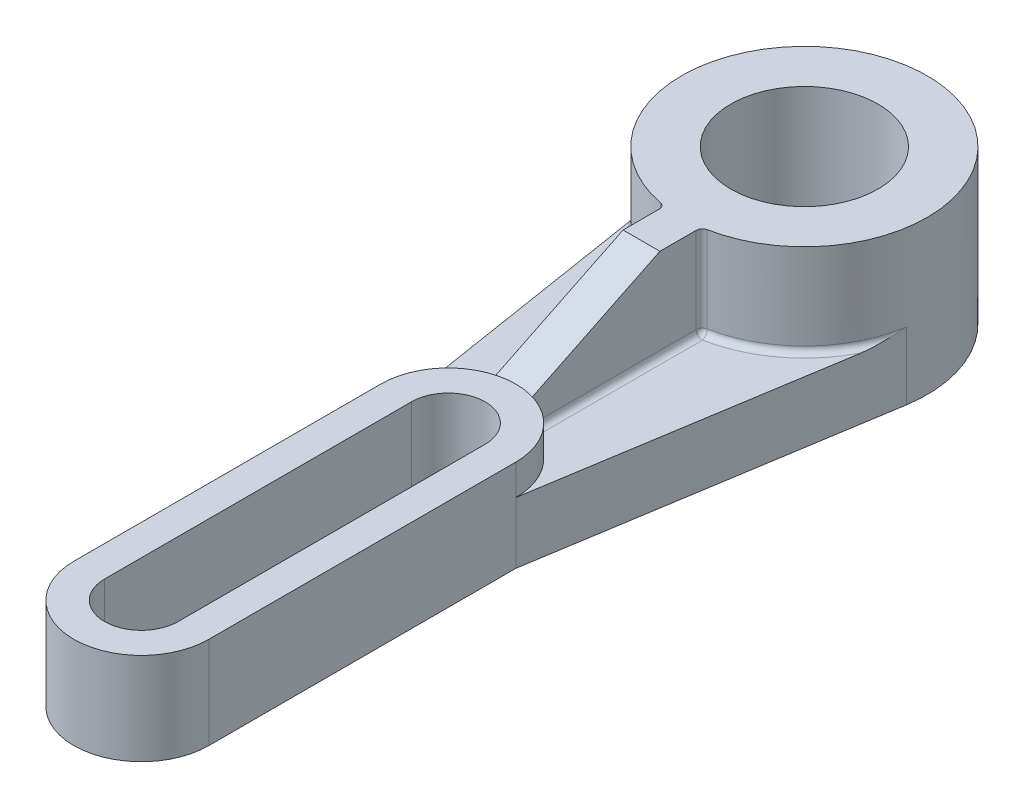
ISO-10303-21;
HEADER;
FILE_DESCRIPTION(('STEP AP214'),'2;1');
FILE_NAME('part.step','',(''),(''),'','','');
FILE_SCHEMA(('AUTOMOTIVE_DESIGN { 1 0 10303 214 1 1 1 1 }'));
ENDSEC;
DATA;
#1=APPLICATION_CONTEXT('core data for automotive mechanical design processes');
#2=APPLICATION_PROTOCOL_DEFINITION('international standard','automotive_design',2000,#1);
#3=PRODUCT_CONTEXT('',#1,'mechanical');
#4=PRODUCT('Part','Part','',(#3));
#5=PRODUCT_RELATED_PRODUCT_CATEGORY('part','',(#4));
#6=PRODUCT_DEFINITION_FORMATION('','',#4);
#7=PRODUCT_DEFINITION_CONTEXT('part definition',#1,'design');
#8=PRODUCT_DEFINITION('design','',#6,#7);
#9=PRODUCT_DEFINITION_SHAPE('','',#8);
#10=(LENGTH_UNIT() NAMED_UNIT(*) SI_UNIT(.MILLI.,.METRE.));
#11=(NAMED_UNIT(*) PLANE_ANGLE_UNIT() SI_UNIT($,.RADIAN.));
#12=(NAMED_UNIT(*) SI_UNIT($,.STERADIAN.) SOLID_ANGLE_UNIT());
#13=UNCERTAINTY_MEASURE_WITH_UNIT(LENGTH_MEASURE(1.E-05),#10,'distance_accuracy_value','');
#14=(GEOMETRIC_REPRESENTATION_CONTEXT(3) GLOBAL_UNCERTAINTY_ASSIGNED_CONTEXT((#13)) GLOBAL_UNIT_ASSIGNED_CONTEXT((#10,
#11,#12)) REPRESENTATION_CONTEXT('',''));
#15=CARTESIAN_POINT('',(0.,0.,0.));
#16=DIRECTION('',(0.,0.,1.));
#17=DIRECTION('',(1.,0.,0.));
#18=AXIS2_PLACEMENT_3D('',#15,#16,#17);
#19=CARTESIAN_POINT('',(0.,10.,0.));
#20=DIRECTION('',(0.,1.,0.));
#21=DIRECTION('',(0.,0.,1.));
#22=AXIS2_PLACEMENT_3D('',#19,#20,#21);
#23=PLANE('',#22);
#24=CARTESIAN_POINT('',(0.,10.,0.));
#25=DIRECTION('',(0.,1.,0.));
#26=DIRECTION('',(0.,0.,1.));
#27=AXIS2_PLACEMENT_3D('',#24,#25,#26);
#28=CIRCLE('',#27,11.);
#29=CARTESIAN_POINT('',(-4.,10.,-10.2469507659596));
#30=VERTEX_POINT('',#29);
#31=CARTESIAN_POINT('',(-11.,10.,0.));
#32=VERTEX_POINT('',#31);
#33=EDGE_CURVE('E236',#30,#32,#28,.T.);
#34=ORIENTED_EDGE('',*,*,#33,.F.);
#35=DIRECTION('',(0.,0.,-1.));
#36=VECTOR('',#35,1.);
#37=CARTESIAN_POINT('',(-4.,10.,0.));
#38=LINE('',#37,#36);
#39=CARTESIAN_POINT('',(-4.,10.,-37.3844718719117));
#40=VERTEX_POINT('',#39);
#41=EDGE_CURVE('E321',#30,#40,#38,.T.);
#42=ORIENTED_EDGE('',*,*,#41,.T.);
#43=CARTESIAN_POINT('',(0.,10.,-58.));
#44=DIRECTION('',(0.,1.,0.));
#45=DIRECTION('',(0.,0.,1.));
#46=AXIS2_PLACEMENT_3D('',#43,#44,#45);
#47=CIRCLE('',#46,21.);
#48=CARTESIAN_POINT('',(-18.7414968926728,10.,-48.5260201487477));
#49=VERTEX_POINT('',#48);
#50=EDGE_CURVE('E319',#40,#49,#47,.F.);
#51=ORIENTED_EDGE('',*,*,#50,.T.);
#52=DIRECTION('',(-0.157540734752383,0.,-0.987512489487439));
#53=VECTOR('',#52,1.);
#54=CARTESIAN_POINT('',(-10.7269900858305,10.,1.71130787488106));
#55=LINE('',#54,#53);
#56=EDGE_CURVE('E261',#32,#49,#55,.T.);
#57=ORIENTED_EDGE('',*,*,#56,.F.);
#58=EDGE_LOOP('',(#34,#42,#51,#57));
#59=FACE_BOUND('',#58,.T.);
#60=ADVANCED_FACE('F35',(#59),#23,.T.);
#61=CARTESIAN_POINT('',(0.,15.,0.));
#62=DIRECTION('',(0.,-1.,0.));
#63=DIRECTION('',(0.,0.,-1.));
#64=AXIS2_PLACEMENT_3D('',#61,#62,#63);
#65=CYLINDRICAL_SURFACE('',#64,11.);
#66=DIRECTION('',(0.,-1.,0.));
#67=VECTOR('',#66,1.);
#68=CARTESIAN_POINT('',(-3.,15.,-10.5830052442584));
#69=LINE('',#68,#67);
#70=CARTESIAN_POINT('',(-3.,11.,-10.5830052442584));
#71=VERTEX_POINT('',#70);
#72=CARTESIAN_POINT('',(-3.,14.7962396583199,-10.5830052442584));
#73=VERTEX_POINT('',#72);
#74=EDGE_CURVE('E204',#71,#73,#69,.F.);
#75=ORIENTED_EDGE('',*,*,#74,.F.);
#76=CARTESIAN_POINT('',(-3.,11.,-10.5830052442584));
#77=CARTESIAN_POINT('',(-2.99999966462213,10.9727171425206,-10.5830047198332));
#78=CARTESIAN_POINT('',(-3.00111728618964,10.9454475483796,-10.5826885912731));
#79=CARTESIAN_POINT('',(-3.00557243898746,10.8911078182624,-10.5814243962143));
#80=CARTESIAN_POINT('',(-3.00890974648202,10.8640376624616,-10.5804763934061));
#81=CARTESIAN_POINT('',(-3.02220557907245,10.7835104152931,-10.5766896375541));
#82=CARTESIAN_POINT('',(-3.0354481967425,10.7305999324658,-10.5729081342815));
#83=CARTESIAN_POINT('',(-3.07023890671703,10.6278561078975,-10.5628574064479));
#84=CARTESIAN_POINT('',(-3.09178886923575,10.5780234619962,-10.5565876216961));
#85=CARTESIAN_POINT('',(-3.14245873589367,10.4827649112002,-10.5416150712215));
#86=CARTESIAN_POINT('',(-3.17157896706883,10.4373391968017,-10.5329122003879));
#87=CARTESIAN_POINT('',(-3.23682810977962,10.3515322270753,-10.5130451030744));
#88=CARTESIAN_POINT('',(-3.27303964352421,10.3112206963373,-10.5018516253187));
#89=CARTESIAN_POINT('',(-3.35106221286166,10.2372613745135,-10.4772159086684));
#90=CARTESIAN_POINT('',(-3.392874008833,10.2036144898638,-10.4637733643437));
#91=CARTESIAN_POINT('',(-3.48239617227888,10.1426060633734,-10.434328520433));
#92=CARTESIAN_POINT('',(-3.53026371583556,10.1155114505525,-10.41825203268));
#93=CARTESIAN_POINT('',(-3.62922769352996,10.069675801372,-10.3841921209767));
#94=CARTESIAN_POINT('',(-3.68032536060174,10.0509379770394,-10.366207967075));
#95=CARTESIAN_POINT('',(-3.77620776190619,10.0242986421606,-10.3316226029508));
#96=CARTESIAN_POINT('',(-3.82073627950436,10.0151639578288,-10.3152422272609));
#97=CARTESIAN_POINT('',(-3.91021840470716,10.0030150087099,-10.2816589845039));
#98=CARTESIAN_POINT('',(-3.95517103371468,9.99998904401214,-10.2644577544413));
#99=CARTESIAN_POINT('',(-4.,10.,-10.2469507659596));
#100=B_SPLINE_CURVE_WITH_KNOTS('',3,(#76,#77,#78,#79,#80,#81,#82,#83,#84,#85,#86,#87,#88,#89,
#90,#91,#92,#93,#94,#95,#96,#97,#98,#99),.UNSPECIFIED.,.F.,.F.,(4,2,2,2,2,2,2,2,2,2,2,4),(0.,
0.08179761532857,0.163586987023812,0.326761183188944,0.48997213587476,0.653190140453051,
0.818437036516682,0.983706391849412,1.15486938786012,1.32609811573937,1.47065929715447,
1.61494333969076),.UNSPECIFIED.);
#101=EDGE_CURVE('E328',#71,#30,#100,.T.);
#102=ORIENTED_EDGE('',*,*,#101,.T.);
#103=ORIENTED_EDGE('',*,*,#33,.T.);
#104=DIRECTION('',(0.,-1.,0.));
#105=VECTOR('',#104,1.);
#106=CARTESIAN_POINT('',(-11.,15.,0.));
#107=LINE('',#106,#105);
#108=CARTESIAN_POINT('',(-11.,15.,0.));
#109=VERTEX_POINT('',#108);
#110=EDGE_CURVE('E255',#109,#32,#107,.T.);
#111=ORIENTED_EDGE('',*,*,#110,.F.);
#112=CARTESIAN_POINT('',(0.,15.,0.));
#113=DIRECTION('',(0.,1.,0.));
#114=DIRECTION('',(0.,0.,1.));
#115=AXIS2_PLACEMENT_3D('',#112,#113,#114);
#116=CIRCLE('',#115,11.);
#117=CARTESIAN_POINT('',(0.,15.,-11.));
#118=VERTEX_POINT('',#117);
#119=EDGE_CURVE('E241',#118,#109,#116,.T.);
#120=ORIENTED_EDGE('',*,*,#119,.F.);
#121=CARTESIAN_POINT('',(0.,9.62495936071319,0.));
#122=DIRECTION('',(0.,-0.898472558001373,-0.439029682958305));
#123=DIRECTION('',(0.,-0.439029682958305,0.898472558001373));
#124=AXIS2_PLACEMENT_3D('',#121,#122,#123);
#125=ELLIPSE('',#124,12.2430005257692,11.);
#126=EDGE_CURVE('E311',#73,#118,#125,.T.);
#127=ORIENTED_EDGE('',*,*,#126,.F.);
#128=EDGE_LOOP('',(#75,#102,#103,#111,#120,#127));
#129=FACE_BOUND('',#128,.T.);
#130=ADVANCED_FACE('F349',(#129),#65,.T.);
#131=CARTESIAN_POINT('',(0.,10.,-58.));
#132=DIRECTION('',(0.,1.,0.));
#133=DIRECTION('',(0.,0.,1.));
#134=AXIS2_PLACEMENT_3D('',#131,#132,#133);
#135=CIRCLE('',#134,21.);
#136=CARTESIAN_POINT('',(18.7414968926728,10.,-48.5260201487477));
#137=VERTEX_POINT('',#136);
#138=CARTESIAN_POINT('',(4.,10.,-37.3844718719117));
#139=VERTEX_POINT('',#138);
#140=EDGE_CURVE('E53',#137,#139,#135,.F.);
#141=ORIENTED_EDGE('',*,*,#140,.T.);
#142=DIRECTION('',(0.,0.,-1.));
#143=VECTOR('',#142,1.);
#144=CARTESIAN_POINT('',(4.,10.,-10.5830052442584));
#145=LINE('',#144,#143);
#146=CARTESIAN_POINT('',(4.,10.,-10.2469507659596));
#147=VERTEX_POINT('',#146);
#148=EDGE_CURVE('E363',#139,#147,#145,.F.);
#149=ORIENTED_EDGE('',*,*,#148,.T.);
#150=CARTESIAN_POINT('',(11.,10.,0.));
#151=VERTEX_POINT('',#150);
#152=EDGE_CURVE('E250',#151,#147,#28,.T.);
#153=ORIENTED_EDGE('',*,*,#152,.F.);
#154=DIRECTION('',(0.157540734752382,0.,-0.987512489487439));
#155=VECTOR('',#154,1.);
#156=CARTESIAN_POINT('',(10.7269900858305,10.,1.71130787488106));
#157=LINE('',#156,#155);
#158=EDGE_CURVE('E259',#151,#137,#157,.T.);
#159=ORIENTED_EDGE('',*,*,#158,.T.);
#160=EDGE_LOOP('',(#141,#149,#153,#159));
#161=FACE_BOUND('',#160,.T.);
#162=ADVANCED_FACE('F351',(#161),#23,.T.);
#163=CARTESIAN_POINT('',(-11.,10.,0.));
#164=DIRECTION('',(1.,0.,0.));
#165=DIRECTION('',(0.,0.,-1.));
#166=AXIS2_PLACEMENT_3D('',#163,#164,#165);
#167=PLANE('',#166);
#168=DIRECTION('',(0.,0.,1.));
#169=VECTOR('',#168,1.);
#170=CARTESIAN_POINT('',(-11.,0.,0.));
#171=LINE('',#170,#169);
#172=CARTESIAN_POINT('',(-11.,0.,0.));
#173=VERTEX_POINT('',#172);
#174=CARTESIAN_POINT('',(-11.,0.,50.));
#175=VERTEX_POINT('',#174);
#176=EDGE_CURVE('E277',#173,#175,#171,.T.);
#177=ORIENTED_EDGE('',*,*,#176,.T.);
#178=DIRECTION('',(0.,-1.,0.));
#179=VECTOR('',#178,1.);
#180=CARTESIAN_POINT('',(-11.,10.,50.));
#181=LINE('',#180,#179);
#182=CARTESIAN_POINT('',(-11.,15.,50.));
#183=VERTEX_POINT('',#182);
#184=EDGE_CURVE('E308',#183,#175,#181,.T.);
#185=ORIENTED_EDGE('',*,*,#184,.F.);
#186=DIRECTION('',(0.,0.,1.));
#187=VECTOR('',#186,1.);
#188=CARTESIAN_POINT('',(-11.,15.,0.));
#189=LINE('',#188,#187);
#190=EDGE_CURVE('E240',#109,#183,#189,.T.);
#191=ORIENTED_EDGE('',*,*,#190,.F.);
#192=ORIENTED_EDGE('',*,*,#110,.T.);
#193=DIRECTION('',(0.,-1.,0.));
#194=VECTOR('',#193,1.);
#195=CARTESIAN_POINT('',(-11.,10.,0.));
#196=LINE('',#195,#194);
#197=EDGE_CURVE('E296',#32,#173,#196,.T.);
#198=ORIENTED_EDGE('',*,*,#197,.T.);
#199=EDGE_LOOP('',(#177,#185,#191,#192,#198));
#200=FACE_BOUND('',#199,.T.);
#201=ADVANCED_FACE('F477',(#200),#167,.F.);
#202=CARTESIAN_POINT('',(0.,10.,50.));
#203=DIRECTION('',(0.,-1.,0.));
#204=DIRECTION('',(0.,0.,-1.));
#205=AXIS2_PLACEMENT_3D('',#202,#203,#204);
#206=CYLINDRICAL_SURFACE('',#205,11.);
#207=CARTESIAN_POINT('',(0.,0.,50.));
#208=DIRECTION('',(0.,1.,0.));
#209=DIRECTION('',(0.,0.,1.));
#210=AXIS2_PLACEMENT_3D('',#207,#208,#209);
#211=CIRCLE('',#210,11.);
#212=CARTESIAN_POINT('',(11.,0.,50.));
#213=VERTEX_POINT('',#212);
#214=EDGE_CURVE('E280',#175,#213,#211,.T.);
#215=ORIENTED_EDGE('',*,*,#214,.T.);
#216=DIRECTION('',(0.,-1.,0.));
#217=VECTOR('',#216,1.);
#218=CARTESIAN_POINT('',(11.,10.,50.));
#219=LINE('',#218,#217);
#220=CARTESIAN_POINT('',(11.,15.,50.));
#221=VERTEX_POINT('',#220);
#222=EDGE_CURVE('E306',#221,#213,#219,.T.);
#223=ORIENTED_EDGE('',*,*,#222,.F.);
#224=CARTESIAN_POINT('',(0.,15.,50.));
#225=DIRECTION('',(0.,1.,0.));
#226=DIRECTION('',(0.,0.,1.));
#227=AXIS2_PLACEMENT_3D('',#224,#225,#226);
#228=CIRCLE('',#227,11.);
#229=EDGE_CURVE('E244',#183,#221,#228,.T.);
#230=ORIENTED_EDGE('',*,*,#229,.F.);
#231=ORIENTED_EDGE('',*,*,#184,.T.);
#232=EDGE_LOOP('',(#215,#223,#230,#231));
#233=FACE_BOUND('',#232,.T.);
#234=ADVANCED_FACE('F480',(#233),#206,.T.);
#235=CARTESIAN_POINT('',(11.,10.,0.));
#236=DIRECTION('',(1.,0.,0.));
#237=DIRECTION('',(0.,0.,-1.));
#238=AXIS2_PLACEMENT_3D('',#235,#236,#237);
#239=PLANE('',#238);
#240=DIRECTION('',(0.,0.,1.));
#241=VECTOR('',#240,1.);
#242=CARTESIAN_POINT('',(11.,0.,0.));
#243=LINE('',#242,#241);
#244=CARTESIAN_POINT('',(11.,0.,0.));
#245=VERTEX_POINT('',#244);
#246=EDGE_CURVE('E283',#245,#213,#243,.T.);
#247=ORIENTED_EDGE('',*,*,#246,.F.);
#248=DIRECTION('',(0.,-1.,0.));
#249=VECTOR('',#248,1.);
#250=CARTESIAN_POINT('',(11.,10.,0.));
#251=LINE('',#250,#249);
#252=EDGE_CURVE('E304',#151,#245,#251,.T.);
#253=ORIENTED_EDGE('',*,*,#252,.F.);
#254=DIRECTION('',(0.,-1.,0.));
#255=VECTOR('',#254,1.);
#256=CARTESIAN_POINT('',(11.,15.,0.));
#257=LINE('',#256,#255);
#258=CARTESIAN_POINT('',(11.,15.,0.));
#259=VERTEX_POINT('',#258);
#260=EDGE_CURVE('E249',#259,#151,#257,.T.);
#261=ORIENTED_EDGE('',*,*,#260,.F.);
#262=DIRECTION('',(0.,0.,-1.));
#263=VECTOR('',#262,1.);
#264=CARTESIAN_POINT('',(11.,15.,0.));
#265=LINE('',#264,#263);
#266=EDGE_CURVE('E247',#221,#259,#265,.T.);
#267=ORIENTED_EDGE('',*,*,#266,.F.);
#268=ORIENTED_EDGE('',*,*,#222,.T.);
#269=EDGE_LOOP('',(#247,#253,#261,#267,#268));
#270=FACE_BOUND('',#269,.T.);
#271=ADVANCED_FACE('F411',(#270),#239,.T.);
#272=CARTESIAN_POINT('',(10.7269900858305,10.,1.71130787488106));
#273=DIRECTION('',(-0.987512489487439,0.,-0.157540734752382));
#274=DIRECTION('',(-0.157540734752382,0.,0.987512489487439));
#275=AXIS2_PLACEMENT_3D('',#272,#273,#274);
#276=PLANE('',#275);
#277=DIRECTION('',(0.157540734752382,0.,-0.987512489487439));
#278=VECTOR('',#277,1.);
#279=CARTESIAN_POINT('',(10.7269900858305,0.,1.71130787488106));
#280=LINE('',#279,#278);
#281=CARTESIAN_POINT('',(19.7502497897488,0.,-54.8491853049524));
#282=VERTEX_POINT('',#281);
#283=EDGE_CURVE('E286',#245,#282,#280,.T.);
#284=ORIENTED_EDGE('',*,*,#283,.T.);
#285=DIRECTION('',(0.,-1.,0.));
#286=VECTOR('',#285,1.);
#287=CARTESIAN_POINT('',(19.7502497897488,10.,-54.8491853049524));
#288=LINE('',#287,#286);
#289=CARTESIAN_POINT('',(19.7502497897488,11.,-54.8491853049524));
#290=VERTEX_POINT('',#289);
#291=EDGE_CURVE('E301',#290,#282,#288,.T.);
#292=ORIENTED_EDGE('',*,*,#291,.F.);
#293=CARTESIAN_POINT('',(18.7414968926728,10.,-48.5260201487477));
#294=CARTESIAN_POINT('',(18.7546919729359,10.0000041494991,-48.6087308621394));
#295=CARTESIAN_POINT('',(18.7678861867093,10.0009778326369,-48.691436144114));
#296=CARTESIAN_POINT('',(18.7942673296592,10.0046907157915,-48.856801046029));
#297=CARTESIAN_POINT('',(18.8074542593938,10.007429753502,-48.9394606694681));
#298=CARTESIAN_POINT('',(18.8469865792676,10.018031465351,-49.1872610855008));
#299=CARTESIAN_POINT('',(18.873316376719,10.0282790812918,-49.3523041384598));
#300=CARTESIAN_POINT('',(18.9258433916416,10.0540164290445,-49.6815591933706));
#301=CARTESIAN_POINT('',(18.952040776009,10.0694929265259,-49.8457722414776));
#302=CARTESIAN_POINT('',(19.0043642942112,10.1048556491149,-50.1737517180229));
#303=CARTESIAN_POINT('',(19.0304904174779,10.124742495745,-50.3375180802165));
#304=CARTESIAN_POINT('',(19.1145689891237,10.1947749583296,-50.8645477384757));
#305=CARTESIAN_POINT('',(19.1723709666382,10.2521837411279,-51.2268678381147));
#306=CARTESIAN_POINT('',(19.2876379858673,10.3792259422311,-51.9493960229274));
#307=CARTESIAN_POINT('',(19.3451029645293,10.448861577232,-52.3096037128687));
#308=CARTESIAN_POINT('',(19.5172649562052,10.6693285286264,-53.3887666180207));
#309=CARTESIAN_POINT('',(19.6315911521697,10.8315810491886,-54.1053974409516));
#310=CARTESIAN_POINT('',(19.7473507663821,10.9958852748545,-54.8310133585892));
#311=CARTESIAN_POINT('',(19.7488002788723,10.9979426534021,-54.8400993368287));
#312=CARTESIAN_POINT('',(19.7502497897488,11.,-54.8491853049524));
#313=B_SPLINE_CURVE_WITH_KNOTS('',3,(#293,#294,#295,#296,#297,#298,#299,#300,#301,#302,#303,
#304,#305,#306,#307,#308,#309,#310,#311,#312),.UNSPECIFIED.,.F.,.F.,(4,2,2,2,2,2,2,2,2,4),(0.,
0.251255591464231,0.502488085820558,1.00470804353271,1.50566628511124,2.00669516846305,
3.12042717756349,4.23436131222792,6.46488509084641,6.49316936209389),.UNSPECIFIED.);
#314=EDGE_CURVE('E11',#290,#137,#313,.F.);
#315=ORIENTED_EDGE('',*,*,#314,.T.);
#316=ORIENTED_EDGE('',*,*,#158,.F.);
#317=ORIENTED_EDGE('',*,*,#252,.T.);
#318=EDGE_LOOP('',(#284,#292,#315,#316,#317));
#319=FACE_BOUND('',#318,.T.);
#320=ADVANCED_FACE('F406',(#319),#276,.F.);
#321=CARTESIAN_POINT('',(0.,10.,-58.));
#322=DIRECTION('',(0.,-1.,0.));
#323=DIRECTION('',(0.,0.,-1.));
#324=AXIS2_PLACEMENT_3D('',#321,#322,#323);
#325=CYLINDRICAL_SURFACE('',#324,20.);
#326=CARTESIAN_POINT('',(0.,11.,-58.));
#327=DIRECTION('',(0.,1.,0.));
#328=DIRECTION('',(0.,0.,1.));
#329=AXIS2_PLACEMENT_3D('',#326,#327,#328);
#330=CIRCLE('',#329,20.);
#331=CARTESIAN_POINT('',(-19.7502497897488,11.,-54.8491853049523));
#332=VERTEX_POINT('',#331);
#333=CARTESIAN_POINT('',(-3.80952380952381,11.,-38.366163687535));
#334=VERTEX_POINT('',#333);
#335=EDGE_CURVE('E439',#332,#334,#330,.T.);
#336=ORIENTED_EDGE('',*,*,#335,.T.);
#337=DIRECTION('',(0.,-1.,0.));
#338=VECTOR('',#337,1.);
#339=CARTESIAN_POINT('',(-3.80952380952381,10.,-38.366163687535));
#340=LINE('',#339,#338);
#341=CARTESIAN_POINT('',(-3.80952380952381,25.,-38.366163687535));
#342=VERTEX_POINT('',#341);
#343=EDGE_CURVE('E440',#334,#342,#340,.F.);
#344=ORIENTED_EDGE('',*,*,#343,.T.);
#345=CARTESIAN_POINT('',(0.,25.,-58.));
#346=DIRECTION('',(0.,1.,0.));
#347=DIRECTION('',(0.,0.,1.));
#348=AXIS2_PLACEMENT_3D('',#345,#346,#347);
#349=CIRCLE('',#348,20.);
#350=CARTESIAN_POINT('',(3.80952380952381,25.,-38.366163687535));
#351=VERTEX_POINT('',#350);
#352=EDGE_CURVE('E221',#351,#342,#349,.T.);
#353=ORIENTED_EDGE('',*,*,#352,.F.);
#354=DIRECTION('',(0.,-1.,0.));
#355=VECTOR('',#354,1.);
#356=CARTESIAN_POINT('',(3.80952380952381,10.,-38.366163687535));
#357=LINE('',#356,#355);
#358=CARTESIAN_POINT('',(3.80952380952381,11.,-38.366163687535));
#359=VERTEX_POINT('',#358);
#360=EDGE_CURVE('E436',#351,#359,#357,.T.);
#361=ORIENTED_EDGE('',*,*,#360,.T.);
#362=CARTESIAN_POINT('',(0.,11.,-58.));
#363=DIRECTION('',(0.,1.,0.));
#364=DIRECTION('',(0.,0.,1.));
#365=AXIS2_PLACEMENT_3D('',#362,#363,#364);
#366=CIRCLE('',#365,20.);
#367=EDGE_CURVE('E336',#359,#290,#366,.T.);
#368=ORIENTED_EDGE('',*,*,#367,.T.);
#369=ORIENTED_EDGE('',*,*,#291,.T.);
#370=CARTESIAN_POINT('',(0.,0.,-58.));
#371=DIRECTION('',(0.,1.,0.));
#372=DIRECTION('',(0.,0.,1.));
#373=AXIS2_PLACEMENT_3D('',#370,#371,#372);
#374=CIRCLE('',#373,20.);
#375=CARTESIAN_POINT('',(-19.7502497897488,0.,-54.8491853049523));
#376=VERTEX_POINT('',#375);
#377=EDGE_CURVE('E288',#282,#376,#374,.T.);
#378=ORIENTED_EDGE('',*,*,#377,.T.);
#379=DIRECTION('',(0.,-1.,0.));
#380=VECTOR('',#379,1.);
#381=CARTESIAN_POINT('',(-19.7502497897488,10.,-54.8491853049523));
#382=LINE('',#381,#380);
#383=EDGE_CURVE('E298',#332,#376,#382,.T.);
#384=ORIENTED_EDGE('',*,*,#383,.F.);
#385=EDGE_LOOP('',(#336,#344,#353,#361,#368,#369,#378,#384));
#386=FACE_BOUND('',#385,.T.);
#387=ADVANCED_FACE('F402',(#386),#325,.T.);
#388=CARTESIAN_POINT('',(0.,10.,0.));
#389=DIRECTION('',(0.,-1.,0.));
#390=DIRECTION('',(0.,0.,-1.));
#391=AXIS2_PLACEMENT_3D('',#388,#389,#390);
#392=CYLINDRICAL_SURFACE('',#391,6.);
#393=CARTESIAN_POINT('',(0.,0.,0.));
#394=DIRECTION('',(0.,1.,0.));
#395=DIRECTION('',(0.,0.,1.));
#396=AXIS2_PLACEMENT_3D('',#393,#394,#395);
#397=CIRCLE('',#396,6.);
#398=CARTESIAN_POINT('',(6.,0.,0.));
#399=VERTEX_POINT('',#398);
#400=CARTESIAN_POINT('',(-6.,0.,0.));
#401=VERTEX_POINT('',#400);
#402=EDGE_CURVE('E258',#399,#401,#397,.T.);
#403=ORIENTED_EDGE('',*,*,#402,.F.);
#404=DIRECTION('',(0.,-1.,0.));
#405=VECTOR('',#404,1.);
#406=CARTESIAN_POINT('',(6.,10.,0.));
#407=LINE('',#406,#405);
#408=CARTESIAN_POINT('',(6.,15.,0.));
#409=VERTEX_POINT('',#408);
#410=EDGE_CURVE('E299',#409,#399,#407,.T.);
#411=ORIENTED_EDGE('',*,*,#410,.F.);
#412=CARTESIAN_POINT('',(0.,15.,0.));
#413=DIRECTION('',(0.,1.,0.));
#414=DIRECTION('',(0.,0.,1.));
#415=AXIS2_PLACEMENT_3D('',#412,#413,#414);
#416=CIRCLE('',#415,6.);
#417=CARTESIAN_POINT('',(-6.,15.,0.));
#418=VERTEX_POINT('',#417);
#419=EDGE_CURVE('E230',#409,#418,#416,.T.);
#420=ORIENTED_EDGE('',*,*,#419,.T.);
#421=DIRECTION('',(0.,-1.,0.));
#422=VECTOR('',#421,1.);
#423=CARTESIAN_POINT('',(-6.,10.,0.));
#424=LINE('',#423,#422);
#425=EDGE_CURVE('E265',#418,#401,#424,.T.);
#426=ORIENTED_EDGE('',*,*,#425,.T.);
#427=EDGE_LOOP('',(#403,#411,#420,#426));
#428=FACE_BOUND('',#427,.T.);
#429=ADVANCED_FACE('F405',(#428),#392,.F.);
#430=CARTESIAN_POINT('',(6.,10.,0.));
#431=DIRECTION('',(1.,0.,0.));
#432=DIRECTION('',(0.,0.,-1.));
#433=AXIS2_PLACEMENT_3D('',#430,#431,#432);
#434=PLANE('',#433);
#435=DIRECTION('',(0.,0.,1.));
#436=VECTOR('',#435,1.);
#437=CARTESIAN_POINT('',(6.,0.,0.));
#438=LINE('',#437,#436);
#439=CARTESIAN_POINT('',(6.00000000000001,0.,50.));
#440=VERTEX_POINT('',#439);
#441=EDGE_CURVE('E268',#399,#440,#438,.T.);
#442=ORIENTED_EDGE('',*,*,#441,.T.);
#443=DIRECTION('',(0.,-1.,0.));
#444=VECTOR('',#443,1.);
#445=CARTESIAN_POINT('',(6.00000000000001,10.,50.));
#446=LINE('',#445,#444);
#447=CARTESIAN_POINT('',(6.00000000000001,15.,50.));
#448=VERTEX_POINT('',#447);
#449=EDGE_CURVE('E315',#448,#440,#446,.T.);
#450=ORIENTED_EDGE('',*,*,#449,.F.);
#451=DIRECTION('',(0.,0.,-1.));
#452=VECTOR('',#451,1.);
#453=CARTESIAN_POINT('',(6.,15.,0.));
#454=LINE('',#453,#452);
#455=EDGE_CURVE('E227',#448,#409,#454,.T.);
#456=ORIENTED_EDGE('',*,*,#455,.T.);
#457=ORIENTED_EDGE('',*,*,#410,.T.);
#458=EDGE_LOOP('',(#442,#450,#456,#457));
#459=FACE_BOUND('',#458,.T.);
#460=ADVANCED_FACE('F519',(#459),#434,.F.);
#461=CARTESIAN_POINT('',(0.,10.,50.));
#462=DIRECTION('',(0.,-1.,0.));
#463=DIRECTION('',(0.,0.,-1.));
#464=AXIS2_PLACEMENT_3D('',#461,#462,#463);
#465=CYLINDRICAL_SURFACE('',#464,6.);
#466=CARTESIAN_POINT('',(0.,0.,50.));
#467=DIRECTION('',(0.,1.,0.));
#468=DIRECTION('',(0.,0.,1.));
#469=AXIS2_PLACEMENT_3D('',#466,#467,#468);
#470=CIRCLE('',#469,6.);
#471=CARTESIAN_POINT('',(-5.99999999999999,0.,50.));
#472=VERTEX_POINT('',#471);
#473=EDGE_CURVE('E271',#472,#440,#470,.T.);
#474=ORIENTED_EDGE('',*,*,#473,.F.);
#475=DIRECTION('',(0.,-1.,0.));
#476=VECTOR('',#475,1.);
#477=CARTESIAN_POINT('',(-5.99999999999999,10.,50.));
#478=LINE('',#477,#476);
#479=CARTESIAN_POINT('',(-5.99999999999999,15.,50.));
#480=VERTEX_POINT('',#479);
#481=EDGE_CURVE('E313',#480,#472,#478,.T.);
#482=ORIENTED_EDGE('',*,*,#481,.F.);
#483=CARTESIAN_POINT('',(0.,15.,50.));
#484=DIRECTION('',(0.,1.,0.));
#485=DIRECTION('',(0.,0.,1.));
#486=AXIS2_PLACEMENT_3D('',#483,#484,#485);
#487=CIRCLE('',#486,6.);
#488=EDGE_CURVE('E224',#480,#448,#487,.T.);
#489=ORIENTED_EDGE('',*,*,#488,.T.);
#490=ORIENTED_EDGE('',*,*,#449,.T.);
#491=EDGE_LOOP('',(#474,#482,#489,#490));
#492=FACE_BOUND('',#491,.T.);
#493=ADVANCED_FACE('F399',(#492),#465,.F.);
#494=CARTESIAN_POINT('',(-10.7269900858305,10.,1.71130787488106));
#495=DIRECTION('',(-0.987512489487439,0.,0.157540734752383));
#496=DIRECTION('',(0.157540734752383,0.,0.987512489487439));
#497=AXIS2_PLACEMENT_3D('',#494,#495,#496);
#498=PLANE('',#497);
#499=DIRECTION('',(-0.157540734752383,0.,-0.987512489487439));
#500=VECTOR('',#499,1.);
#501=CARTESIAN_POINT('',(-10.7269900858305,0.,1.71130787488106));
#502=LINE('',#501,#500);
#503=EDGE_CURVE('E291',#173,#376,#502,.T.);
#504=ORIENTED_EDGE('',*,*,#503,.F.);
#505=ORIENTED_EDGE('',*,*,#197,.F.);
#506=ORIENTED_EDGE('',*,*,#56,.T.);
#507=CARTESIAN_POINT('',(-18.7414968926728,10.,-48.5260201487477));
#508=CARTESIAN_POINT('',(-18.7546919729359,10.0000041494991,-48.6087308621392));
#509=CARTESIAN_POINT('',(-18.7678861867093,10.0009778326369,-48.6914361441135));
#510=CARTESIAN_POINT('',(-18.7942673296591,10.0046907157915,-48.856801046028));
#511=CARTESIAN_POINT('',(-18.8074542593937,10.0074297535019,-48.9394606694669));
#512=CARTESIAN_POINT('',(-18.8469865792673,10.0180314653509,-49.1872610854989));
#513=CARTESIAN_POINT('',(-18.8733163767186,10.0282790812916,-49.3523041384575));
#514=CARTESIAN_POINT('',(-18.9258433916413,10.0540164290442,-49.6815591933685));
#515=CARTESIAN_POINT('',(-18.9520407760088,10.0694929265257,-49.845772241476));
#516=CARTESIAN_POINT('',(-19.0043642942111,10.1048556491149,-50.1737517180221));
#517=CARTESIAN_POINT('',(-19.0304904174779,10.1247424957451,-50.3375180802161));
#518=CARTESIAN_POINT('',(-19.1145689891237,10.1947749583293,-50.8645477384759));
#519=CARTESIAN_POINT('',(-19.1723709666383,10.2521837411262,-51.2268678381154));
#520=CARTESIAN_POINT('',(-19.2876379858674,10.379225942233,-51.9493960229279));
#521=CARTESIAN_POINT('',(-19.3451029645292,10.4488615772389,-52.3096037128685));
#522=CARTESIAN_POINT('',(-19.517264956206,10.6693285286131,-53.3887666180248));
#523=CARTESIAN_POINT('',(-19.6315911521728,10.8315810491146,-54.1053974409684));
#524=CARTESIAN_POINT('',(-19.7473507663822,10.9958852748526,-54.8310133585896));
#525=CARTESIAN_POINT('',(-19.7488002788724,10.9979426534011,-54.8400993368289));
#526=CARTESIAN_POINT('',(-19.7502497897488,11.,-54.8491853049523));
#527=B_SPLINE_CURVE_WITH_KNOTS('',3,(#507,#508,#509,#510,#511,#512,#513,#514,#515,#516,#517,
#518,#519,#520,#521,#522,#523,#524,#525,#526),.UNSPECIFIED.,.F.,.F.,(4,2,2,2,2,2,2,2,2,4),(0.,
0.251255591463458,0.502488085819025,1.00470804352998,1.50566628510998,2.00669516846305,
3.12042717756394,4.23436131222966,6.46488509084637,6.49316936209385),.UNSPECIFIED.);
#528=EDGE_CURVE('E385',#49,#332,#527,.T.);
#529=ORIENTED_EDGE('',*,*,#528,.T.);
#530=ORIENTED_EDGE('',*,*,#383,.T.);
#531=EDGE_LOOP('',(#504,#505,#506,#529,#530));
#532=FACE_BOUND('',#531,.T.);
#533=ADVANCED_FACE('F393',(#532),#498,.T.);
#534=CARTESIAN_POINT('',(-6.,10.,0.));
#535=DIRECTION('',(1.,0.,0.));
#536=DIRECTION('',(0.,0.,-1.));
#537=AXIS2_PLACEMENT_3D('',#534,#535,#536);
#538=PLANE('',#537);
#539=DIRECTION('',(0.,0.,1.));
#540=VECTOR('',#539,1.);
#541=CARTESIAN_POINT('',(-6.,0.,0.));
#542=LINE('',#541,#540);
#543=EDGE_CURVE('E274',#401,#472,#542,.T.);
#544=ORIENTED_EDGE('',*,*,#543,.F.);
#545=ORIENTED_EDGE('',*,*,#425,.F.);
#546=DIRECTION('',(0.,0.,1.));
#547=VECTOR('',#546,1.);
#548=CARTESIAN_POINT('',(-6.,15.,0.));
#549=LINE('',#548,#547);
#550=EDGE_CURVE('E233',#418,#480,#549,.T.);
#551=ORIENTED_EDGE('',*,*,#550,.T.);
#552=ORIENTED_EDGE('',*,*,#481,.T.);
#553=EDGE_LOOP('',(#544,#545,#551,#552));
#554=FACE_BOUND('',#553,.T.);
#555=ADVANCED_FACE('F398',(#554),#538,.T.);
#556=CARTESIAN_POINT('',(0.,10.,-58.));
#557=DIRECTION('',(0.,-1.,0.));
#558=DIRECTION('',(0.,0.,-1.));
#559=AXIS2_PLACEMENT_3D('',#556,#557,#558);
#560=CYLINDRICAL_SURFACE('',#559,12.);
#561=CARTESIAN_POINT('',(0.,0.,-58.));
#562=DIRECTION('',(0.,1.,0.));
#563=DIRECTION('',(0.,0.,1.));
#564=AXIS2_PLACEMENT_3D('',#561,#562,#563);
#565=CIRCLE('',#564,12.);
#566=CARTESIAN_POINT('',(0.,0.,-46.));
#567=VERTEX_POINT('',#566);
#568=EDGE_CURVE('E262',#567,#567,#565,.T.);
#569=ORIENTED_EDGE('',*,*,#568,.F.);
#570=EDGE_LOOP('',(#569));
#571=FACE_BOUND('',#570,.T.);
#572=CARTESIAN_POINT('',(0.,25.,-58.));
#573=DIRECTION('',(0.,1.,0.));
#574=DIRECTION('',(0.,0.,1.));
#575=AXIS2_PLACEMENT_3D('',#572,#573,#574);
#576=CIRCLE('',#575,12.);
#577=CARTESIAN_POINT('',(0.,25.,-46.));
#578=VERTEX_POINT('',#577);
#579=EDGE_CURVE('E218',#578,#578,#576,.T.);
#580=ORIENTED_EDGE('',*,*,#579,.T.);
#581=EDGE_LOOP('',(#580));
#582=FACE_BOUND('',#581,.T.);
#583=ADVANCED_FACE('F401',(#571,#582),#560,.F.);
#584=CARTESIAN_POINT('',(0.,0.,0.));
#585=DIRECTION('',(0.,1.,0.));
#586=DIRECTION('',(0.,0.,1.));
#587=AXIS2_PLACEMENT_3D('',#584,#585,#586);
#588=PLANE('',#587);
#589=ORIENTED_EDGE('',*,*,#402,.T.);
#590=ORIENTED_EDGE('',*,*,#543,.T.);
#591=ORIENTED_EDGE('',*,*,#473,.T.);
#592=ORIENTED_EDGE('',*,*,#441,.F.);
#593=EDGE_LOOP('',(#589,#590,#591,#592));
#594=FACE_BOUND('',#593,.T.);
#595=ORIENTED_EDGE('',*,*,#176,.F.);
#596=ORIENTED_EDGE('',*,*,#503,.T.);
#597=ORIENTED_EDGE('',*,*,#377,.F.);
#598=ORIENTED_EDGE('',*,*,#283,.F.);
#599=ORIENTED_EDGE('',*,*,#246,.T.);
#600=ORIENTED_EDGE('',*,*,#214,.F.);
#601=EDGE_LOOP('',(#595,#596,#597,#598,#599,#600));
#602=FACE_BOUND('',#601,.T.);
#603=ORIENTED_EDGE('',*,*,#568,.T.);
#604=EDGE_LOOP('',(#603));
#605=FACE_BOUND('',#604,.T.);
#606=ADVANCED_FACE('F486',(#594,#602,#605),#588,.F.);
#607=CARTESIAN_POINT('',(0.,15.,0.));
#608=DIRECTION('',(0.,1.,0.));
#609=DIRECTION('',(0.,0.,1.));
#610=AXIS2_PLACEMENT_3D('',#607,#608,#609);
#611=PLANE('',#610);
#612=EDGE_CURVE('E237',#259,#118,#116,.T.);
#613=ORIENTED_EDGE('',*,*,#612,.T.);
#614=ORIENTED_EDGE('',*,*,#119,.T.);
#615=ORIENTED_EDGE('',*,*,#190,.T.);
#616=ORIENTED_EDGE('',*,*,#229,.T.);
#617=ORIENTED_EDGE('',*,*,#266,.T.);
#618=EDGE_LOOP('',(#613,#614,#615,#616,#617));
#619=FACE_BOUND('',#618,.T.);
#620=ORIENTED_EDGE('',*,*,#455,.F.);
#621=ORIENTED_EDGE('',*,*,#488,.F.);
#622=ORIENTED_EDGE('',*,*,#550,.F.);
#623=ORIENTED_EDGE('',*,*,#419,.F.);
#624=EDGE_LOOP('',(#620,#621,#622,#623));
#625=FACE_BOUND('',#624,.T.);
#626=ADVANCED_FACE('F347',(#619,#625),#611,.T.);
#627=ORIENTED_EDGE('',*,*,#152,.T.);
#628=CARTESIAN_POINT('',(4.,10.,-10.2469507659596));
#629=CARTESIAN_POINT('',(3.94218282821431,9.99995815874123,-10.2695424821726));
#630=CARTESIAN_POINT('',(3.88412438206162,10.0050142324328,-10.2916205234511));
#631=CARTESIAN_POINT('',(3.76912573970361,10.0252739975155,-10.3342797515139));
#632=CARTESIAN_POINT('',(3.7121877334643,10.0404958543072,-10.3548581854868));
#633=CARTESIAN_POINT('',(3.60114629583233,10.081076646312,-10.3940007111556));
#634=CARTESIAN_POINT('',(3.54704837308026,10.1064545139996,-10.4125609579779));
#635=CARTESIAN_POINT('',(3.44371580434273,10.1668599131325,-10.4471901492455));
#636=CARTESIAN_POINT('',(3.39447586185584,10.2018767739636,-10.4632618180473));
#637=CARTESIAN_POINT('',(3.30475757782195,10.2789083281504,-10.4919350406514));
#638=CARTESIAN_POINT('',(3.26398126516397,10.3205291221112,-10.5046618025528));
#639=CARTESIAN_POINT('',(3.18998333620104,10.4107019685363,-10.5273695050921));
#640=CARTESIAN_POINT('',(3.15676284194439,10.4592550487133,-10.5373500379577));
#641=CARTESIAN_POINT('',(3.10063699828304,10.5592394847763,-10.5539976929686));
#642=CARTESIAN_POINT('',(3.07729838838787,10.6104049304427,-10.5608057179091));
#643=CARTESIAN_POINT('',(3.03949274166662,10.716152888876,-10.5717489390426));
#644=CARTESIAN_POINT('',(3.02501506666217,10.7707312170841,-10.5758873406307));
#645=CARTESIAN_POINT('',(3.0101616205822,10.8548368771444,-10.5801205974908));
#646=CARTESIAN_POINT('',(3.00635219905289,10.8837502956288,-10.5812030086236));
#647=CARTESIAN_POINT('',(3.00127304191083,10.9417709852227,-10.5826444443807));
#648=CARTESIAN_POINT('',(2.99999928960173,10.9708778763412,-10.5830046130996));
#649=CARTESIAN_POINT('',(3.,11.,-10.5830052442584));
#650=B_SPLINE_CURVE_WITH_KNOTS('',3,(#628,#629,#630,#631,#632,#633,#634,#635,#636,#637,#638,
#639,#640,#641,#642,#643,#644,#645,#646,#647,#648,#649),.UNSPECIFIED.,.F.,.F.,(4,2,2,2,2,2,2,2,
2,2,4),(0.,0.186073893202043,0.372481177662971,0.559237586822805,0.745788077548686,
0.92379554479119,1.10182942912661,1.27094749759261,1.43986212753887,1.52730700083335,
1.61461324410245),.UNSPECIFIED.);
#651=CARTESIAN_POINT('',(3.,11.,-10.5830052442584));
#652=VERTEX_POINT('',#651);
#653=EDGE_CURVE('E355',#147,#652,#650,.T.);
#654=ORIENTED_EDGE('',*,*,#653,.T.);
#655=DIRECTION('',(0.,-1.,0.));
#656=VECTOR('',#655,1.);
#657=CARTESIAN_POINT('',(3.,15.,-10.5830052442584));
#658=LINE('',#657,#656);
#659=CARTESIAN_POINT('',(3.,14.7962396583199,-10.5830052442583));
#660=VERTEX_POINT('',#659);
#661=EDGE_CURVE('E216',#652,#660,#658,.F.);
#662=ORIENTED_EDGE('',*,*,#661,.T.);
#663=EDGE_CURVE('E209',#118,#660,#125,.T.);
#664=ORIENTED_EDGE('',*,*,#663,.F.);
#665=ORIENTED_EDGE('',*,*,#612,.F.);
#666=ORIENTED_EDGE('',*,*,#260,.T.);
#667=EDGE_LOOP('',(#627,#654,#662,#664,#665,#666));
#668=FACE_BOUND('',#667,.T.);
#669=ADVANCED_FACE('F342',(#668),#65,.T.);
#670=CARTESIAN_POINT('',(0.,25.,-58.));
#671=DIRECTION('',(0.,1.,0.));
#672=DIRECTION('',(0.,0.,1.));
#673=AXIS2_PLACEMENT_3D('',#670,#671,#672);
#674=PLANE('',#673);
#675=DIRECTION('',(0.,0.,1.));
#676=VECTOR('',#675,1.);
#677=CARTESIAN_POINT('',(3.,25.,-41.4960056633902));
#678=LINE('',#677,#676);
#679=CARTESIAN_POINT('',(3.,25.,-37.3844718719117));
#680=VERTEX_POINT('',#679);
#681=CARTESIAN_POINT('',(3.,25.,-31.4649615476387));
#682=VERTEX_POINT('',#681);
#683=EDGE_CURVE('E183',#680,#682,#678,.T.);
#684=ORIENTED_EDGE('',*,*,#683,.F.);
#685=CARTESIAN_POINT('',(4.,25.,-37.3844718719117));
#686=DIRECTION('',(0.,1.,0.));
#687=DIRECTION('',(0.,0.,1.));
#688=AXIS2_PLACEMENT_3D('',#685,#686,#687);
#689=CIRCLE('',#688,1.);
#690=EDGE_CURVE('E45',#680,#351,#689,.F.);
#691=ORIENTED_EDGE('',*,*,#690,.T.);
#692=ORIENTED_EDGE('',*,*,#352,.T.);
#693=CARTESIAN_POINT('',(-4.,25.,-37.3844718719117));
#694=DIRECTION('',(0.,1.,0.));
#695=DIRECTION('',(0.,0.,1.));
#696=AXIS2_PLACEMENT_3D('',#693,#694,#695);
#697=CIRCLE('',#696,1.);
#698=CARTESIAN_POINT('',(-3.,25.,-37.3844718719117));
#699=VERTEX_POINT('',#698);
#700=EDGE_CURVE('E362',#342,#699,#697,.F.);
#701=ORIENTED_EDGE('',*,*,#700,.T.);
#702=DIRECTION('',(0.,0.,1.));
#703=VECTOR('',#702,1.);
#704=CARTESIAN_POINT('',(-3.,25.,-41.4960056633902));
#705=LINE('',#704,#703);
#706=CARTESIAN_POINT('',(-3.,25.,-31.4649615476387));
#707=VERTEX_POINT('',#706);
#708=EDGE_CURVE('E200',#699,#707,#705,.T.);
#709=ORIENTED_EDGE('',*,*,#708,.T.);
#710=DIRECTION('',(-1.,0.,0.));
#711=VECTOR('',#710,1.);
#712=CARTESIAN_POINT('',(3.,25.,-31.4649615476387));
#713=LINE('',#712,#711);
#714=EDGE_CURVE('E196',#682,#707,#713,.T.);
#715=ORIENTED_EDGE('',*,*,#714,.F.);
#716=EDGE_LOOP('',(#684,#691,#692,#701,#709,#715));
#717=FACE_BOUND('',#716,.T.);
#718=ORIENTED_EDGE('',*,*,#579,.F.);
#719=EDGE_LOOP('',(#718));
#720=FACE_BOUND('',#719,.T.);
#721=ADVANCED_FACE('F197',(#717,#720),#674,.T.);
#722=CARTESIAN_POINT('',(3.,0.,0.));
#723=DIRECTION('',(1.,0.,0.));
#724=DIRECTION('',(0.,0.,-1.));
#725=AXIS2_PLACEMENT_3D('',#722,#723,#724);
#726=PLANE('',#725);
#727=DIRECTION('',(0.,0.,-1.));
#728=VECTOR('',#727,1.);
#729=CARTESIAN_POINT('',(3.,11.,-38.2262800667148));
#730=LINE('',#729,#728);
#731=CARTESIAN_POINT('',(3.,11.,-37.3844718719117));
#732=VERTEX_POINT('',#731);
#733=EDGE_CURVE('E444',#652,#732,#730,.T.);
#734=ORIENTED_EDGE('',*,*,#733,.T.);
#735=DIRECTION('',(0.,-1.,0.));
#736=VECTOR('',#735,1.);
#737=CARTESIAN_POINT('',(3.,0.,-37.3844718719117));
#738=LINE('',#737,#736);
#739=EDGE_CURVE('E190',#732,#680,#738,.F.);
#740=ORIENTED_EDGE('',*,*,#739,.T.);
#741=ORIENTED_EDGE('',*,*,#683,.T.);
#742=DIRECTION('',(0.,-0.439029682958305,0.898472558001373));
#743=VECTOR('',#742,1.);
#744=CARTESIAN_POINT('',(3.,25.,-31.4649615476387));
#745=LINE('',#744,#743);
#746=EDGE_CURVE('E188',#682,#660,#745,.T.);
#747=ORIENTED_EDGE('',*,*,#746,.T.);
#748=ORIENTED_EDGE('',*,*,#661,.F.);
#749=EDGE_LOOP('',(#734,#740,#741,#747,#748));
#750=FACE_BOUND('',#749,.T.);
#751=ADVANCED_FACE('F185',(#750),#726,.T.);
#752=CARTESIAN_POINT('',(-3.,0.,0.));
#753=DIRECTION('',(1.,0.,0.));
#754=DIRECTION('',(0.,0.,-1.));
#755=AXIS2_PLACEMENT_3D('',#752,#753,#754);
#756=PLANE('',#755);
#757=DIRECTION('',(0.,1.,0.));
#758=VECTOR('',#757,1.);
#759=CARTESIAN_POINT('',(-3.,10.,-37.3844718719117));
#760=LINE('',#759,#758);
#761=CARTESIAN_POINT('',(-3.,11.,-37.3844718719117));
#762=VERTEX_POINT('',#761);
#763=EDGE_CURVE('E324',#699,#762,#760,.F.);
#764=ORIENTED_EDGE('',*,*,#763,.T.);
#765=DIRECTION('',(0.,0.,-1.));
#766=VECTOR('',#765,1.);
#767=CARTESIAN_POINT('',(-3.,11.,0.));
#768=LINE('',#767,#766);
#769=EDGE_CURVE('E326',#762,#71,#768,.F.);
#770=ORIENTED_EDGE('',*,*,#769,.T.);
#771=ORIENTED_EDGE('',*,*,#74,.T.);
#772=DIRECTION('',(0.,-0.439029682958305,0.898472558001373));
#773=VECTOR('',#772,1.);
#774=CARTESIAN_POINT('',(-3.,25.,-31.4649615476387));
#775=LINE('',#774,#773);
#776=EDGE_CURVE('E193',#707,#73,#775,.T.);
#777=ORIENTED_EDGE('',*,*,#776,.F.);
#778=ORIENTED_EDGE('',*,*,#708,.F.);
#779=EDGE_LOOP('',(#764,#770,#771,#777,#778));
#780=FACE_BOUND('',#779,.T.);
#781=ADVANCED_FACE('F461',(#780),#756,.F.);
#782=CARTESIAN_POINT('',(3.,25.,-31.4649615476387));
#783=DIRECTION('',(0.,-0.898472558001373,-0.439029682958305));
#784=DIRECTION('',(0.,0.439029682958305,-0.898472558001373));
#785=AXIS2_PLACEMENT_3D('',#782,#783,#784);
#786=PLANE('',#785);
#787=ORIENTED_EDGE('',*,*,#776,.T.);
#788=ORIENTED_EDGE('',*,*,#126,.T.);
#789=ORIENTED_EDGE('',*,*,#663,.T.);
#790=ORIENTED_EDGE('',*,*,#746,.F.);
#791=ORIENTED_EDGE('',*,*,#714,.T.);
#792=EDGE_LOOP('',(#787,#788,#789,#790,#791));
#793=FACE_BOUND('',#792,.T.);
#794=ADVANCED_FACE('F207',(#793),#786,.F.);
#795=CARTESIAN_POINT('',(0.,11.,-58.));
#796=DIRECTION('',(0.,1.,0.));
#797=DIRECTION('',(0.,0.,1.));
#798=AXIS2_PLACEMENT_3D('',#795,#796,#797);
#799=TOROIDAL_SURFACE('',#798,21.,1.);
#800=ORIENTED_EDGE('',*,*,#528,.F.);
#801=ORIENTED_EDGE('',*,*,#50,.F.);
#802=CARTESIAN_POINT('',(-4.,11.,-37.3844718719117));
#803=DIRECTION('',(-0.981691815623252,0.,-0.190476190476191));
#804=DIRECTION('',(-0.190476190476191,0.,0.981691815623252));
#805=AXIS2_PLACEMENT_3D('',#802,#803,#804);
#806=CIRCLE('',#805,1.);
#807=EDGE_CURVE('E213',#334,#40,#806,.T.);
#808=ORIENTED_EDGE('',*,*,#807,.F.);
#809=ORIENTED_EDGE('',*,*,#335,.F.);
#810=EDGE_LOOP('',(#800,#801,#808,#809));
#811=FACE_BOUND('',#810,.T.);
#812=ADVANCED_FACE('F379',(#811),#799,.F.);
#813=CARTESIAN_POINT('',(-4.,10.,-37.3844718719117));
#814=DIRECTION('',(0.,-1.,0.));
#815=DIRECTION('',(0.,0.,-1.));
#816=AXIS2_PLACEMENT_3D('',#813,#814,#815);
#817=CYLINDRICAL_SURFACE('',#816,1.);
#818=ORIENTED_EDGE('',*,*,#700,.F.);
#819=ORIENTED_EDGE('',*,*,#343,.F.);
#820=CARTESIAN_POINT('',(-4.,11.,-37.3844718719117));
#821=DIRECTION('',(0.,1.,0.));
#822=DIRECTION('',(0.,0.,1.));
#823=AXIS2_PLACEMENT_3D('',#820,#821,#822);
#824=CIRCLE('',#823,1.);
#825=EDGE_CURVE('E420',#762,#334,#824,.T.);
#826=ORIENTED_EDGE('',*,*,#825,.F.);
#827=ORIENTED_EDGE('',*,*,#763,.F.);
#828=EDGE_LOOP('',(#818,#819,#826,#827));
#829=FACE_BOUND('',#828,.T.);
#830=ADVANCED_FACE('F383',(#829),#817,.F.);
#831=CARTESIAN_POINT('',(-4.,11.,-37.3844718719117));
#832=DIRECTION('',(0.,0.,1.));
#833=DIRECTION('',(1.,0.,0.));
#834=AXIS2_PLACEMENT_3D('',#831,#832,#833);
#835=SPHERICAL_SURFACE('',#834,1.);
#836=ORIENTED_EDGE('',*,*,#825,.T.);
#837=ORIENTED_EDGE('',*,*,#807,.T.);
#838=CARTESIAN_POINT('',(-4.,11.,-37.3844718719117));
#839=DIRECTION('',(0.,0.,1.));
#840=DIRECTION('',(1.,0.,0.));
#841=AXIS2_PLACEMENT_3D('',#838,#839,#840);
#842=CIRCLE('',#841,1.);
#843=EDGE_CURVE('E418',#762,#40,#842,.F.);
#844=ORIENTED_EDGE('',*,*,#843,.F.);
#845=EDGE_LOOP('',(#836,#837,#844));
#846=FACE_BOUND('',#845,.T.);
#847=ADVANCED_FACE('F588',(#846),#835,.F.);
#848=CARTESIAN_POINT('',(-4.,11.,0.));
#849=DIRECTION('',(0.,0.,-1.));
#850=DIRECTION('',(-1.,0.,0.));
#851=AXIS2_PLACEMENT_3D('',#848,#849,#850);
#852=CYLINDRICAL_SURFACE('',#851,1.);
#853=ORIENTED_EDGE('',*,*,#101,.F.);
#854=ORIENTED_EDGE('',*,*,#769,.F.);
#855=ORIENTED_EDGE('',*,*,#843,.T.);
#856=ORIENTED_EDGE('',*,*,#41,.F.);
#857=EDGE_LOOP('',(#853,#854,#855,#856));
#858=FACE_BOUND('',#857,.T.);
#859=ADVANCED_FACE('F338',(#858),#852,.F.);
#860=CARTESIAN_POINT('',(0.,11.,-58.));
#861=DIRECTION('',(0.,1.,0.));
#862=DIRECTION('',(0.,0.,1.));
#863=AXIS2_PLACEMENT_3D('',#860,#861,#862);
#864=TOROIDAL_SURFACE('',#863,21.,1.);
#865=ORIENTED_EDGE('',*,*,#314,.F.);
#866=ORIENTED_EDGE('',*,*,#367,.F.);
#867=CARTESIAN_POINT('',(4.,11.,-37.3844718719117));
#868=DIRECTION('',(0.981691815623252,0.,-0.190476190476191));
#869=DIRECTION('',(-0.190476190476191,0.,-0.981691815623252));
#870=AXIS2_PLACEMENT_3D('',#867,#868,#869);
#871=CIRCLE('',#870,1.);
#872=EDGE_CURVE('E40',#139,#359,#871,.T.);
#873=ORIENTED_EDGE('',*,*,#872,.F.);
#874=ORIENTED_EDGE('',*,*,#140,.F.);
#875=EDGE_LOOP('',(#865,#866,#873,#874));
#876=FACE_BOUND('',#875,.T.);
#877=ADVANCED_FACE('F37',(#876),#864,.F.);
#878=CARTESIAN_POINT('',(4.,11.,0.));
#879=DIRECTION('',(0.,0.,1.));
#880=DIRECTION('',(1.,0.,0.));
#881=AXIS2_PLACEMENT_3D('',#878,#879,#880);
#882=CYLINDRICAL_SURFACE('',#881,1.);
#883=ORIENTED_EDGE('',*,*,#653,.F.);
#884=ORIENTED_EDGE('',*,*,#148,.F.);
#885=CARTESIAN_POINT('',(4.,11.,-37.3844718719117));
#886=DIRECTION('',(0.,0.,1.));
#887=DIRECTION('',(1.,0.,0.));
#888=AXIS2_PLACEMENT_3D('',#885,#886,#887);
#889=CIRCLE('',#888,1.);
#890=EDGE_CURVE('E426',#732,#139,#889,.T.);
#891=ORIENTED_EDGE('',*,*,#890,.F.);
#892=ORIENTED_EDGE('',*,*,#733,.F.);
#893=EDGE_LOOP('',(#883,#884,#891,#892));
#894=FACE_BOUND('',#893,.T.);
#895=ADVANCED_FACE('F366',(#894),#882,.F.);
#896=CARTESIAN_POINT('',(4.,11.,-37.3844718719117));
#897=DIRECTION('',(0.,0.,1.));
#898=DIRECTION('',(1.,0.,0.));
#899=AXIS2_PLACEMENT_3D('',#896,#897,#898);
#900=SPHERICAL_SURFACE('',#899,1.);
#901=ORIENTED_EDGE('',*,*,#890,.T.);
#902=ORIENTED_EDGE('',*,*,#872,.T.);
#903=CARTESIAN_POINT('',(4.,11.,-37.3844718719117));
#904=DIRECTION('',(0.,1.,0.));
#905=DIRECTION('',(0.,0.,1.));
#906=AXIS2_PLACEMENT_3D('',#903,#904,#905);
#907=CIRCLE('',#906,1.);
#908=EDGE_CURVE('E425',#732,#359,#907,.F.);
#909=ORIENTED_EDGE('',*,*,#908,.F.);
#910=EDGE_LOOP('',(#901,#902,#909));
#911=FACE_BOUND('',#910,.T.);
#912=ADVANCED_FACE('F370',(#911),#900,.F.);
#913=CARTESIAN_POINT('',(4.,10.,-37.3844718719117));
#914=DIRECTION('',(0.,-1.,0.));
#915=DIRECTION('',(0.,0.,-1.));
#916=AXIS2_PLACEMENT_3D('',#913,#914,#915);
#917=CYLINDRICAL_SURFACE('',#916,1.);
#918=ORIENTED_EDGE('',*,*,#690,.F.);
#919=ORIENTED_EDGE('',*,*,#739,.F.);
#920=ORIENTED_EDGE('',*,*,#908,.T.);
#921=ORIENTED_EDGE('',*,*,#360,.F.);
#922=EDGE_LOOP('',(#918,#919,#920,#921));
#923=FACE_BOUND('',#922,.T.);
#924=ADVANCED_FACE('F374',(#923),#917,.F.);
#925=CLOSED_SHELL('',(#60,#130,#162,#201,#234,#271,#320,#387,#429,#460,#493,#533,#555,#583,#606,
#626,#669,#721,#751,#781,#794,#812,#830,#847,#859,#877,#895,#912,#924));
#926=MANIFOLD_SOLID_BREP('B2',#925);
#927=ADVANCED_BREP_SHAPE_REPRESENTATION('',(#18,#926),#14);
#928=SHAPE_DEFINITION_REPRESENTATION(#9,#927);
ENDSEC;
END-ISO-10303-21;
